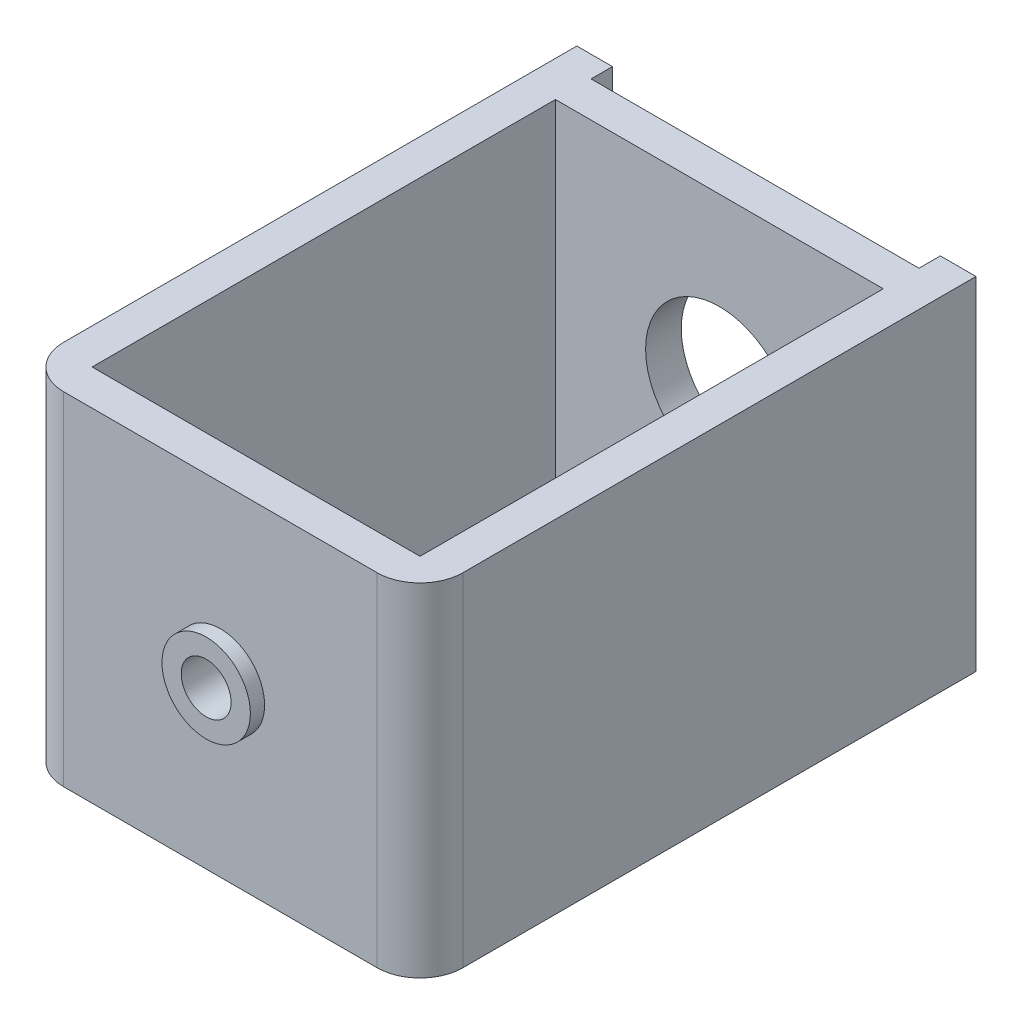
ISO-10303-21;
HEADER;
FILE_DESCRIPTION(('STEP AP214'),'2;1');
FILE_NAME('part.step','',(''),(''),'','','');
FILE_SCHEMA(('AUTOMOTIVE_DESIGN { 1 0 10303 214 1 1 1 1 }'));
ENDSEC;
DATA;
#1=APPLICATION_CONTEXT('core data for automotive mechanical design processes');
#2=APPLICATION_PROTOCOL_DEFINITION('international standard','automotive_design',2000,#1);
#3=PRODUCT_CONTEXT('',#1,'mechanical');
#4=PRODUCT('Part','Part','',(#3));
#5=PRODUCT_RELATED_PRODUCT_CATEGORY('part','',(#4));
#6=PRODUCT_DEFINITION_FORMATION('','',#4);
#7=PRODUCT_DEFINITION_CONTEXT('part definition',#1,'design');
#8=PRODUCT_DEFINITION('design','',#6,#7);
#9=PRODUCT_DEFINITION_SHAPE('','',#8);
#10=(LENGTH_UNIT() NAMED_UNIT(*) SI_UNIT(.MILLI.,.METRE.));
#11=(NAMED_UNIT(*) PLANE_ANGLE_UNIT() SI_UNIT($,.RADIAN.));
#12=(NAMED_UNIT(*) SI_UNIT($,.STERADIAN.) SOLID_ANGLE_UNIT());
#13=UNCERTAINTY_MEASURE_WITH_UNIT(LENGTH_MEASURE(1.E-05),#10,'distance_accuracy_value','');
#14=(GEOMETRIC_REPRESENTATION_CONTEXT(3) GLOBAL_UNCERTAINTY_ASSIGNED_CONTEXT((#13)) GLOBAL_UNIT_ASSIGNED_CONTEXT((#10,
#11,#12)) REPRESENTATION_CONTEXT('',''));
#15=CARTESIAN_POINT('',(0.,0.,0.));
#16=DIRECTION('',(0.,0.,1.));
#17=DIRECTION('',(1.,0.,0.));
#18=AXIS2_PLACEMENT_3D('',#15,#16,#17);
#19=CARTESIAN_POINT('',(0.,0.,0.));
#20=DIRECTION('',(0.,0.,-1.));
#21=DIRECTION('',(-1.,0.,0.));
#22=AXIS2_PLACEMENT_3D('',#19,#20,#21);
#23=PLANE('',#22);
#24=DIRECTION('',(0.,1.,0.));
#25=VECTOR('',#24,1.);
#26=CARTESIAN_POINT('',(2.5,0.,0.));
#27=LINE('',#26,#25);
#28=CARTESIAN_POINT('',(2.5,0.,0.));
#29=VERTEX_POINT('',#28);
#30=CARTESIAN_POINT('',(2.5,24.,0.));
#31=VERTEX_POINT('',#30);
#32=EDGE_CURVE('E176',#29,#31,#27,.T.);
#33=ORIENTED_EDGE('',*,*,#32,.F.);
#34=DIRECTION('',(1.,0.,0.));
#35=VECTOR('',#34,1.);
#36=CARTESIAN_POINT('',(0.,0.,0.));
#37=LINE('',#36,#35);
#38=CARTESIAN_POINT('',(0.,0.,0.));
#39=VERTEX_POINT('',#38);
#40=EDGE_CURVE('E222',#39,#29,#37,.T.);
#41=ORIENTED_EDGE('',*,*,#40,.F.);
#42=DIRECTION('',(0.,-1.,0.));
#43=VECTOR('',#42,1.);
#44=CARTESIAN_POINT('',(0.,0.,0.));
#45=LINE('',#44,#43);
#46=CARTESIAN_POINT('',(0.,24.,0.));
#47=VERTEX_POINT('',#46);
#48=EDGE_CURVE('E182',#47,#39,#45,.T.);
#49=ORIENTED_EDGE('',*,*,#48,.F.);
#50=DIRECTION('',(-1.,0.,0.));
#51=VECTOR('',#50,1.);
#52=CARTESIAN_POINT('',(0.,24.,0.));
#53=LINE('',#52,#51);
#54=EDGE_CURVE('E228',#31,#47,#53,.T.);
#55=ORIENTED_EDGE('',*,*,#54,.F.);
#56=EDGE_LOOP('',(#33,#41,#49,#55));
#57=FACE_BOUND('',#56,.T.);
#58=ADVANCED_FACE('F36',(#57),#23,.T.);
#59=CARTESIAN_POINT('',(0.,0.,39.));
#60=DIRECTION('',(1.,0.,0.));
#61=DIRECTION('',(0.,0.,-1.));
#62=AXIS2_PLACEMENT_3D('',#59,#60,#61);
#63=PLANE('',#62);
#64=DIRECTION('',(0.,0.,-1.));
#65=VECTOR('',#64,1.);
#66=CARTESIAN_POINT('',(0.,0.,39.));
#67=LINE('',#66,#65);
#68=CARTESIAN_POINT('',(0.,0.,36.));
#69=VERTEX_POINT('',#68);
#70=EDGE_CURVE('E236',#69,#39,#67,.T.);
#71=ORIENTED_EDGE('',*,*,#70,.F.);
#72=DIRECTION('',(0.,-1.,0.));
#73=VECTOR('',#72,1.);
#74=CARTESIAN_POINT('',(0.,0.,36.));
#75=LINE('',#74,#73);
#76=CARTESIAN_POINT('',(0.,24.,36.));
#77=VERTEX_POINT('',#76);
#78=EDGE_CURVE('E59',#69,#77,#75,.F.);
#79=ORIENTED_EDGE('',*,*,#78,.T.);
#80=DIRECTION('',(0.,0.,-1.));
#81=VECTOR('',#80,1.);
#82=CARTESIAN_POINT('',(0.,24.,39.));
#83=LINE('',#82,#81);
#84=EDGE_CURVE('E218',#77,#47,#83,.T.);
#85=ORIENTED_EDGE('',*,*,#84,.T.);
#86=ORIENTED_EDGE('',*,*,#48,.T.);
#87=EDGE_LOOP('',(#71,#79,#85,#86));
#88=FACE_BOUND('',#87,.T.);
#89=ADVANCED_FACE('F271',(#88),#63,.F.);
#90=CARTESIAN_POINT('',(0.,0.,39.));
#91=DIRECTION('',(0.,1.,0.));
#92=DIRECTION('',(0.,0.,1.));
#93=AXIS2_PLACEMENT_3D('',#90,#91,#92);
#94=PLANE('',#93);
#95=DIRECTION('',(-1.,0.,0.));
#96=VECTOR('',#95,1.);
#97=CARTESIAN_POINT('',(2.5,0.,4.));
#98=LINE('',#97,#96);
#99=CARTESIAN_POINT('',(25.5,0.,4.));
#100=VERTEX_POINT('',#99);
#101=CARTESIAN_POINT('',(2.5,0.,4.));
#102=VERTEX_POINT('',#101);
#103=EDGE_CURVE('E150',#100,#102,#98,.T.);
#104=ORIENTED_EDGE('',*,*,#103,.T.);
#105=DIRECTION('',(0.,0.,1.));
#106=VECTOR('',#105,1.);
#107=CARTESIAN_POINT('',(2.5,0.,4.));
#108=LINE('',#107,#106);
#109=CARTESIAN_POINT('',(2.5,0.,36.5));
#110=VERTEX_POINT('',#109);
#111=EDGE_CURVE('E142',#102,#110,#108,.T.);
#112=ORIENTED_EDGE('',*,*,#111,.T.);
#113=DIRECTION('',(1.,0.,0.));
#114=VECTOR('',#113,1.);
#115=CARTESIAN_POINT('',(2.5,0.,36.5));
#116=LINE('',#115,#114);
#117=CARTESIAN_POINT('',(25.5,0.,36.5));
#118=VERTEX_POINT('',#117);
#119=EDGE_CURVE('E154',#110,#118,#116,.T.);
#120=ORIENTED_EDGE('',*,*,#119,.T.);
#121=DIRECTION('',(0.,0.,-1.));
#122=VECTOR('',#121,1.);
#123=CARTESIAN_POINT('',(25.5,0.,4.));
#124=LINE('',#123,#122);
#125=EDGE_CURVE('E158',#118,#100,#124,.T.);
#126=ORIENTED_EDGE('',*,*,#125,.T.);
#127=EDGE_LOOP('',(#104,#112,#120,#126));
#128=FACE_BOUND('',#127,.T.);
#129=DIRECTION('',(1.,0.,0.));
#130=VECTOR('',#129,1.);
#131=CARTESIAN_POINT('',(0.,0.,39.));
#132=LINE('',#131,#130);
#133=CARTESIAN_POINT('',(3.,0.,39.));
#134=VERTEX_POINT('',#133);
#135=CARTESIAN_POINT('',(25.,0.,39.));
#136=VERTEX_POINT('',#135);
#137=EDGE_CURVE('E211',#134,#136,#132,.T.);
#138=ORIENTED_EDGE('',*,*,#137,.F.);
#139=CARTESIAN_POINT('',(3.,0.,36.));
#140=DIRECTION('',(0.,1.,0.));
#141=DIRECTION('',(0.,0.,1.));
#142=AXIS2_PLACEMENT_3D('',#139,#140,#141);
#143=CIRCLE('',#142,3.);
#144=EDGE_CURVE('E246',#134,#69,#143,.F.);
#145=ORIENTED_EDGE('',*,*,#144,.T.);
#146=ORIENTED_EDGE('',*,*,#70,.T.);
#147=ORIENTED_EDGE('',*,*,#40,.T.);
#148=DIRECTION('',(0.,0.,1.));
#149=VECTOR('',#148,1.);
#150=CARTESIAN_POINT('',(2.5,0.,0.));
#151=LINE('',#150,#149);
#152=CARTESIAN_POINT('',(2.5,0.,1.5));
#153=VERTEX_POINT('',#152);
#154=EDGE_CURVE('E186',#29,#153,#151,.T.);
#155=ORIENTED_EDGE('',*,*,#154,.T.);
#156=DIRECTION('',(1.,0.,0.));
#157=VECTOR('',#156,1.);
#158=CARTESIAN_POINT('',(2.5,0.,1.5));
#159=LINE('',#158,#157);
#160=CARTESIAN_POINT('',(25.5,0.,1.5));
#161=VERTEX_POINT('',#160);
#162=EDGE_CURVE('E189',#153,#161,#159,.T.);
#163=ORIENTED_EDGE('',*,*,#162,.T.);
#164=DIRECTION('',(0.,0.,-1.));
#165=VECTOR('',#164,1.);
#166=CARTESIAN_POINT('',(25.5,0.,0.));
#167=LINE('',#166,#165);
#168=CARTESIAN_POINT('',(25.5,0.,0.));
#169=VERTEX_POINT('',#168);
#170=EDGE_CURVE('E193',#161,#169,#167,.T.);
#171=ORIENTED_EDGE('',*,*,#170,.T.);
#172=CARTESIAN_POINT('',(28.,0.,0.));
#173=VERTEX_POINT('',#172);
#174=EDGE_CURVE('E221',#169,#173,#37,.T.);
#175=ORIENTED_EDGE('',*,*,#174,.T.);
#176=DIRECTION('',(0.,0.,-1.));
#177=VECTOR('',#176,1.);
#178=CARTESIAN_POINT('',(28.,0.,39.));
#179=LINE('',#178,#177);
#180=CARTESIAN_POINT('',(28.,0.,36.));
#181=VERTEX_POINT('',#180);
#182=EDGE_CURVE('E234',#181,#173,#179,.T.);
#183=ORIENTED_EDGE('',*,*,#182,.F.);
#184=CARTESIAN_POINT('',(25.,0.,36.));
#185=DIRECTION('',(0.,1.,0.));
#186=DIRECTION('',(0.,0.,1.));
#187=AXIS2_PLACEMENT_3D('',#184,#185,#186);
#188=CIRCLE('',#187,3.);
#189=EDGE_CURVE('E244',#181,#136,#188,.F.);
#190=ORIENTED_EDGE('',*,*,#189,.T.);
#191=EDGE_LOOP('',(#138,#145,#146,#147,#155,#163,#171,#175,#183,#190));
#192=FACE_BOUND('',#191,.T.);
#193=ADVANCED_FACE('F160',(#128,#192),#94,.F.);
#194=CARTESIAN_POINT('',(28.,0.,39.));
#195=DIRECTION('',(-1.,0.,0.));
#196=DIRECTION('',(0.,0.,1.));
#197=AXIS2_PLACEMENT_3D('',#194,#195,#196);
#198=PLANE('',#197);
#199=DIRECTION('',(0.,0.,-1.));
#200=VECTOR('',#199,1.);
#201=CARTESIAN_POINT('',(28.,24.,39.));
#202=LINE('',#201,#200);
#203=CARTESIAN_POINT('',(28.,24.,36.));
#204=VERTEX_POINT('',#203);
#205=CARTESIAN_POINT('',(28.,24.,0.));
#206=VERTEX_POINT('',#205);
#207=EDGE_CURVE('E232',#204,#206,#202,.T.);
#208=ORIENTED_EDGE('',*,*,#207,.F.);
#209=DIRECTION('',(0.,1.,0.));
#210=VECTOR('',#209,1.);
#211=CARTESIAN_POINT('',(28.,0.,36.));
#212=LINE('',#211,#210);
#213=EDGE_CURVE('E44',#204,#181,#212,.F.);
#214=ORIENTED_EDGE('',*,*,#213,.T.);
#215=ORIENTED_EDGE('',*,*,#182,.T.);
#216=DIRECTION('',(0.,1.,0.));
#217=VECTOR('',#216,1.);
#218=CARTESIAN_POINT('',(28.,0.,0.));
#219=LINE('',#218,#217);
#220=EDGE_CURVE('E225',#173,#206,#219,.T.);
#221=ORIENTED_EDGE('',*,*,#220,.T.);
#222=EDGE_LOOP('',(#208,#214,#215,#221));
#223=FACE_BOUND('',#222,.T.);
#224=ADVANCED_FACE('F254',(#223),#198,.F.);
#225=CARTESIAN_POINT('',(0.,24.,39.));
#226=DIRECTION('',(0.,-1.,0.));
#227=DIRECTION('',(0.,0.,-1.));
#228=AXIS2_PLACEMENT_3D('',#225,#226,#227);
#229=PLANE('',#228);
#230=DIRECTION('',(1.,0.,0.));
#231=VECTOR('',#230,1.);
#232=CARTESIAN_POINT('',(2.5,24.,36.5));
#233=LINE('',#232,#231);
#234=CARTESIAN_POINT('',(2.5,24.,36.5));
#235=VERTEX_POINT('',#234);
#236=CARTESIAN_POINT('',(25.5,24.,36.5));
#237=VERTEX_POINT('',#236);
#238=EDGE_CURVE('E175',#235,#237,#233,.T.);
#239=ORIENTED_EDGE('',*,*,#238,.F.);
#240=DIRECTION('',(0.,0.,1.));
#241=VECTOR('',#240,1.);
#242=CARTESIAN_POINT('',(2.5,24.,4.));
#243=LINE('',#242,#241);
#244=CARTESIAN_POINT('',(2.5,24.,4.));
#245=VERTEX_POINT('',#244);
#246=EDGE_CURVE('E145',#245,#235,#243,.T.);
#247=ORIENTED_EDGE('',*,*,#246,.F.);
#248=DIRECTION('',(-1.,0.,0.));
#249=VECTOR('',#248,1.);
#250=CARTESIAN_POINT('',(2.5,24.,4.));
#251=LINE('',#250,#249);
#252=CARTESIAN_POINT('',(25.5,24.,4.));
#253=VERTEX_POINT('',#252);
#254=EDGE_CURVE('E163',#253,#245,#251,.T.);
#255=ORIENTED_EDGE('',*,*,#254,.F.);
#256=DIRECTION('',(0.,0.,-1.));
#257=VECTOR('',#256,1.);
#258=CARTESIAN_POINT('',(25.5,24.,4.));
#259=LINE('',#258,#257);
#260=EDGE_CURVE('E166',#237,#253,#259,.T.);
#261=ORIENTED_EDGE('',*,*,#260,.F.);
#262=EDGE_LOOP('',(#239,#247,#255,#261));
#263=FACE_BOUND('',#262,.T.);
#264=ORIENTED_EDGE('',*,*,#84,.F.);
#265=CARTESIAN_POINT('',(3.,24.,36.));
#266=DIRECTION('',(0.,-1.,0.));
#267=DIRECTION('',(0.,0.,-1.));
#268=AXIS2_PLACEMENT_3D('',#265,#266,#267);
#269=CIRCLE('',#268,3.);
#270=CARTESIAN_POINT('',(3.,24.,39.));
#271=VERTEX_POINT('',#270);
#272=EDGE_CURVE('E250',#77,#271,#269,.F.);
#273=ORIENTED_EDGE('',*,*,#272,.T.);
#274=DIRECTION('',(-1.,0.,0.));
#275=VECTOR('',#274,1.);
#276=CARTESIAN_POINT('',(0.,24.,39.));
#277=LINE('',#276,#275);
#278=CARTESIAN_POINT('',(25.,24.,39.));
#279=VERTEX_POINT('',#278);
#280=EDGE_CURVE('E214',#279,#271,#277,.T.);
#281=ORIENTED_EDGE('',*,*,#280,.F.);
#282=CARTESIAN_POINT('',(25.,24.,36.));
#283=DIRECTION('',(0.,-1.,0.));
#284=DIRECTION('',(0.,0.,-1.));
#285=AXIS2_PLACEMENT_3D('',#282,#283,#284);
#286=CIRCLE('',#285,3.);
#287=EDGE_CURVE('E51',#279,#204,#286,.F.);
#288=ORIENTED_EDGE('',*,*,#287,.T.);
#289=ORIENTED_EDGE('',*,*,#207,.T.);
#290=CARTESIAN_POINT('',(25.5,24.,0.));
#291=VERTEX_POINT('',#290);
#292=EDGE_CURVE('E215',#206,#291,#53,.T.);
#293=ORIENTED_EDGE('',*,*,#292,.T.);
#294=DIRECTION('',(0.,0.,-1.));
#295=VECTOR('',#294,1.);
#296=CARTESIAN_POINT('',(25.5,24.,0.));
#297=LINE('',#296,#295);
#298=CARTESIAN_POINT('',(25.5,24.,1.5));
#299=VERTEX_POINT('',#298);
#300=EDGE_CURVE('E190',#299,#291,#297,.T.);
#301=ORIENTED_EDGE('',*,*,#300,.F.);
#302=DIRECTION('',(1.,0.,0.));
#303=VECTOR('',#302,1.);
#304=CARTESIAN_POINT('',(2.5,24.,1.5));
#305=LINE('',#304,#303);
#306=CARTESIAN_POINT('',(2.5,24.,1.5));
#307=VERTEX_POINT('',#306);
#308=EDGE_CURVE('E200',#307,#299,#305,.T.);
#309=ORIENTED_EDGE('',*,*,#308,.F.);
#310=DIRECTION('',(0.,0.,1.));
#311=VECTOR('',#310,1.);
#312=CARTESIAN_POINT('',(2.5,24.,0.));
#313=LINE('',#312,#311);
#314=EDGE_CURVE('E197',#31,#307,#313,.T.);
#315=ORIENTED_EDGE('',*,*,#314,.F.);
#316=ORIENTED_EDGE('',*,*,#54,.T.);
#317=EDGE_LOOP('',(#264,#273,#281,#288,#289,#293,#301,#309,#315,#316));
#318=FACE_BOUND('',#317,.T.);
#319=ADVANCED_FACE('F265',(#263,#318),#229,.F.);
#320=CARTESIAN_POINT('',(0.,0.,39.));
#321=DIRECTION('',(0.,0.,-1.));
#322=DIRECTION('',(-1.,0.,0.));
#323=AXIS2_PLACEMENT_3D('',#320,#321,#322);
#324=PLANE('',#323);
#325=CARTESIAN_POINT('',(14.,12.,39.));
#326=DIRECTION('',(0.,0.,-1.));
#327=DIRECTION('',(-1.,0.,0.));
#328=AXIS2_PLACEMENT_3D('',#325,#326,#327);
#329=CIRCLE('',#328,3.1);
#330=CARTESIAN_POINT('',(10.9,12.,39.));
#331=VERTEX_POINT('',#330);
#332=EDGE_CURVE('E11',#331,#331,#329,.F.);
#333=ORIENTED_EDGE('',*,*,#332,.F.);
#334=EDGE_LOOP('',(#333));
#335=FACE_BOUND('',#334,.T.);
#336=ORIENTED_EDGE('',*,*,#280,.T.);
#337=DIRECTION('',(0.,-1.,0.));
#338=VECTOR('',#337,1.);
#339=CARTESIAN_POINT('',(3.,0.,39.));
#340=LINE('',#339,#338);
#341=EDGE_CURVE('E241',#271,#134,#340,.T.);
#342=ORIENTED_EDGE('',*,*,#341,.T.);
#343=ORIENTED_EDGE('',*,*,#137,.T.);
#344=DIRECTION('',(0.,1.,0.));
#345=VECTOR('',#344,1.);
#346=CARTESIAN_POINT('',(25.,0.,39.));
#347=LINE('',#346,#345);
#348=EDGE_CURVE('E238',#136,#279,#347,.T.);
#349=ORIENTED_EDGE('',*,*,#348,.T.);
#350=EDGE_LOOP('',(#336,#342,#343,#349));
#351=FACE_BOUND('',#350,.T.);
#352=ADVANCED_FACE('F263',(#335,#351),#324,.F.);
#353=DIRECTION('',(0.,1.,0.));
#354=VECTOR('',#353,1.);
#355=CARTESIAN_POINT('',(25.5,0.,0.));
#356=LINE('',#355,#354);
#357=EDGE_CURVE('E205',#169,#291,#356,.T.);
#358=ORIENTED_EDGE('',*,*,#357,.T.);
#359=ORIENTED_EDGE('',*,*,#292,.F.);
#360=ORIENTED_EDGE('',*,*,#220,.F.);
#361=ORIENTED_EDGE('',*,*,#174,.F.);
#362=EDGE_LOOP('',(#358,#359,#360,#361));
#363=FACE_BOUND('',#362,.T.);
#364=ADVANCED_FACE('F288',(#363),#23,.T.);
#365=CARTESIAN_POINT('',(2.5,0.,0.));
#366=DIRECTION('',(-1.,0.,0.));
#367=DIRECTION('',(0.,0.,1.));
#368=AXIS2_PLACEMENT_3D('',#365,#366,#367);
#369=PLANE('',#368);
#370=ORIENTED_EDGE('',*,*,#314,.T.);
#371=DIRECTION('',(0.,1.,0.));
#372=VECTOR('',#371,1.);
#373=CARTESIAN_POINT('',(2.5,0.,1.5));
#374=LINE('',#373,#372);
#375=EDGE_CURVE('E196',#153,#307,#374,.T.);
#376=ORIENTED_EDGE('',*,*,#375,.F.);
#377=ORIENTED_EDGE('',*,*,#154,.F.);
#378=ORIENTED_EDGE('',*,*,#32,.T.);
#379=EDGE_LOOP('',(#370,#376,#377,#378));
#380=FACE_BOUND('',#379,.T.);
#381=ADVANCED_FACE('F278',(#380),#369,.F.);
#382=CARTESIAN_POINT('',(25.5,0.,0.));
#383=DIRECTION('',(1.,0.,0.));
#384=DIRECTION('',(0.,0.,-1.));
#385=AXIS2_PLACEMENT_3D('',#382,#383,#384);
#386=PLANE('',#385);
#387=ORIENTED_EDGE('',*,*,#300,.T.);
#388=ORIENTED_EDGE('',*,*,#357,.F.);
#389=ORIENTED_EDGE('',*,*,#170,.F.);
#390=DIRECTION('',(0.,1.,0.));
#391=VECTOR('',#390,1.);
#392=CARTESIAN_POINT('',(25.5,0.,1.5));
#393=LINE('',#392,#391);
#394=EDGE_CURVE('E208',#161,#299,#393,.T.);
#395=ORIENTED_EDGE('',*,*,#394,.T.);
#396=EDGE_LOOP('',(#387,#388,#389,#395));
#397=FACE_BOUND('',#396,.T.);
#398=ADVANCED_FACE('F286',(#397),#386,.F.);
#399=CARTESIAN_POINT('',(2.5,0.,1.5));
#400=DIRECTION('',(0.,0.,1.));
#401=DIRECTION('',(1.,0.,0.));
#402=AXIS2_PLACEMENT_3D('',#399,#400,#401);
#403=PLANE('',#402);
#404=CARTESIAN_POINT('',(14.,12.,1.5));
#405=DIRECTION('',(0.,0.,1.));
#406=DIRECTION('',(1.,0.,0.));
#407=AXIS2_PLACEMENT_3D('',#404,#405,#406);
#408=CIRCLE('',#407,5.175);
#409=CARTESIAN_POINT('',(19.175,12.,1.5));
#410=VERTEX_POINT('',#409);
#411=EDGE_CURVE('E169',#410,#410,#408,.F.);
#412=ORIENTED_EDGE('',*,*,#411,.F.);
#413=EDGE_LOOP('',(#412));
#414=FACE_BOUND('',#413,.T.);
#415=ORIENTED_EDGE('',*,*,#308,.T.);
#416=ORIENTED_EDGE('',*,*,#394,.F.);
#417=ORIENTED_EDGE('',*,*,#162,.F.);
#418=ORIENTED_EDGE('',*,*,#375,.T.);
#419=EDGE_LOOP('',(#415,#416,#417,#418));
#420=FACE_BOUND('',#419,.T.);
#421=ADVANCED_FACE('F282',(#414,#420),#403,.F.);
#422=CARTESIAN_POINT('',(2.5,0.,4.));
#423=DIRECTION('',(-1.,0.,0.));
#424=DIRECTION('',(0.,0.,1.));
#425=AXIS2_PLACEMENT_3D('',#422,#423,#424);
#426=PLANE('',#425);
#427=ORIENTED_EDGE('',*,*,#246,.T.);
#428=DIRECTION('',(0.,1.,0.));
#429=VECTOR('',#428,1.);
#430=CARTESIAN_POINT('',(2.5,0.,36.5));
#431=LINE('',#430,#429);
#432=EDGE_CURVE('E138',#110,#235,#431,.T.);
#433=ORIENTED_EDGE('',*,*,#432,.F.);
#434=ORIENTED_EDGE('',*,*,#111,.F.);
#435=DIRECTION('',(0.,1.,0.));
#436=VECTOR('',#435,1.);
#437=CARTESIAN_POINT('',(2.5,0.,4.));
#438=LINE('',#437,#436);
#439=EDGE_CURVE('E180',#102,#245,#438,.T.);
#440=ORIENTED_EDGE('',*,*,#439,.T.);
#441=EDGE_LOOP('',(#427,#433,#434,#440));
#442=FACE_BOUND('',#441,.T.);
#443=ADVANCED_FACE('F140',(#442),#426,.F.);
#444=CARTESIAN_POINT('',(2.5,0.,4.));
#445=DIRECTION('',(0.,0.,-1.));
#446=DIRECTION('',(-1.,0.,0.));
#447=AXIS2_PLACEMENT_3D('',#444,#445,#446);
#448=PLANE('',#447);
#449=CARTESIAN_POINT('',(14.,12.,4.));
#450=DIRECTION('',(0.,0.,-1.));
#451=DIRECTION('',(-1.,0.,0.));
#452=AXIS2_PLACEMENT_3D('',#449,#450,#451);
#453=CIRCLE('',#452,5.175);
#454=CARTESIAN_POINT('',(8.825,12.,4.));
#455=VERTEX_POINT('',#454);
#456=EDGE_CURVE('E352',#455,#455,#453,.F.);
#457=ORIENTED_EDGE('',*,*,#456,.F.);
#458=EDGE_LOOP('',(#457));
#459=FACE_BOUND('',#458,.T.);
#460=ORIENTED_EDGE('',*,*,#254,.T.);
#461=ORIENTED_EDGE('',*,*,#439,.F.);
#462=ORIENTED_EDGE('',*,*,#103,.F.);
#463=DIRECTION('',(0.,1.,0.));
#464=VECTOR('',#463,1.);
#465=CARTESIAN_POINT('',(25.5,0.,4.));
#466=LINE('',#465,#464);
#467=EDGE_CURVE('E183',#100,#253,#466,.T.);
#468=ORIENTED_EDGE('',*,*,#467,.T.);
#469=EDGE_LOOP('',(#460,#461,#462,#468));
#470=FACE_BOUND('',#469,.T.);
#471=ADVANCED_FACE('F330',(#459,#470),#448,.F.);
#472=CARTESIAN_POINT('',(25.5,0.,4.));
#473=DIRECTION('',(1.,0.,0.));
#474=DIRECTION('',(0.,0.,-1.));
#475=AXIS2_PLACEMENT_3D('',#472,#473,#474);
#476=PLANE('',#475);
#477=ORIENTED_EDGE('',*,*,#260,.T.);
#478=ORIENTED_EDGE('',*,*,#467,.F.);
#479=ORIENTED_EDGE('',*,*,#125,.F.);
#480=DIRECTION('',(0.,1.,0.));
#481=VECTOR('',#480,1.);
#482=CARTESIAN_POINT('',(25.5,0.,36.5));
#483=LINE('',#482,#481);
#484=EDGE_CURVE('E149',#118,#237,#483,.T.);
#485=ORIENTED_EDGE('',*,*,#484,.T.);
#486=EDGE_LOOP('',(#477,#478,#479,#485));
#487=FACE_BOUND('',#486,.T.);
#488=ADVANCED_FACE('F333',(#487),#476,.F.);
#489=CARTESIAN_POINT('',(2.5,0.,36.5));
#490=DIRECTION('',(0.,0.,1.));
#491=DIRECTION('',(1.,0.,0.));
#492=AXIS2_PLACEMENT_3D('',#489,#490,#491);
#493=PLANE('',#492);
#494=CARTESIAN_POINT('',(14.,12.,36.5));
#495=DIRECTION('',(0.,0.,1.));
#496=DIRECTION('',(1.,0.,0.));
#497=AXIS2_PLACEMENT_3D('',#494,#495,#496);
#498=CIRCLE('',#497,1.75);
#499=CARTESIAN_POINT('',(15.75,12.,36.5));
#500=VERTEX_POINT('',#499);
#501=EDGE_CURVE('E354',#500,#500,#498,.F.);
#502=ORIENTED_EDGE('',*,*,#501,.F.);
#503=EDGE_LOOP('',(#502));
#504=FACE_BOUND('',#503,.T.);
#505=ORIENTED_EDGE('',*,*,#238,.T.);
#506=ORIENTED_EDGE('',*,*,#484,.F.);
#507=ORIENTED_EDGE('',*,*,#119,.F.);
#508=ORIENTED_EDGE('',*,*,#432,.T.);
#509=EDGE_LOOP('',(#505,#506,#507,#508));
#510=FACE_BOUND('',#509,.T.);
#511=ADVANCED_FACE('F155',(#504,#510),#493,.F.);
#512=CARTESIAN_POINT('',(14.,12.,39.001));
#513=DIRECTION('',(0.,0.,-1.));
#514=DIRECTION('',(-1.,0.,0.));
#515=AXIS2_PLACEMENT_3D('',#512,#513,#514);
#516=CYLINDRICAL_SURFACE('',#515,5.175);
#517=ORIENTED_EDGE('',*,*,#456,.T.);
#518=EDGE_LOOP('',(#517));
#519=FACE_BOUND('',#518,.T.);
#520=ORIENTED_EDGE('',*,*,#411,.T.);
#521=EDGE_LOOP('',(#520));
#522=FACE_BOUND('',#521,.T.);
#523=ADVANCED_FACE('F317',(#519,#522),#516,.F.);
#524=CARTESIAN_POINT('',(14.,12.,-0.001000000000001));
#525=DIRECTION('',(0.,0.,1.));
#526=DIRECTION('',(1.,0.,0.));
#527=AXIS2_PLACEMENT_3D('',#524,#525,#526);
#528=CYLINDRICAL_SURFACE('',#527,1.75);
#529=ORIENTED_EDGE('',*,*,#501,.T.);
#530=EDGE_LOOP('',(#529));
#531=FACE_BOUND('',#530,.T.);
#532=CARTESIAN_POINT('',(14.,12.,40.));
#533=DIRECTION('',(0.,0.,1.));
#534=DIRECTION('',(1.,0.,0.));
#535=AXIS2_PLACEMENT_3D('',#532,#533,#534);
#536=CIRCLE('',#535,1.75);
#537=CARTESIAN_POINT('',(15.75,12.,40.));
#538=VERTEX_POINT('',#537);
#539=EDGE_CURVE('E361',#538,#538,#536,.F.);
#540=ORIENTED_EDGE('',*,*,#539,.F.);
#541=EDGE_LOOP('',(#540));
#542=FACE_BOUND('',#541,.T.);
#543=ADVANCED_FACE('F311',(#531,#542),#528,.F.);
#544=CARTESIAN_POINT('',(3.,0.,36.));
#545=DIRECTION('',(0.,-1.,0.));
#546=DIRECTION('',(0.,0.,-1.));
#547=AXIS2_PLACEMENT_3D('',#544,#545,#546);
#548=CYLINDRICAL_SURFACE('',#547,3.);
#549=ORIENTED_EDGE('',*,*,#272,.F.);
#550=ORIENTED_EDGE('',*,*,#78,.F.);
#551=ORIENTED_EDGE('',*,*,#144,.F.);
#552=ORIENTED_EDGE('',*,*,#341,.F.);
#553=EDGE_LOOP('',(#549,#550,#551,#552));
#554=FACE_BOUND('',#553,.T.);
#555=ADVANCED_FACE('F269',(#554),#548,.T.);
#556=CARTESIAN_POINT('',(25.,0.,36.));
#557=DIRECTION('',(0.,1.,0.));
#558=DIRECTION('',(0.,0.,1.));
#559=AXIS2_PLACEMENT_3D('',#556,#557,#558);
#560=CYLINDRICAL_SURFACE('',#559,3.);
#561=ORIENTED_EDGE('',*,*,#189,.F.);
#562=ORIENTED_EDGE('',*,*,#213,.F.);
#563=ORIENTED_EDGE('',*,*,#287,.F.);
#564=ORIENTED_EDGE('',*,*,#348,.F.);
#565=EDGE_LOOP('',(#561,#562,#563,#564));
#566=FACE_BOUND('',#565,.T.);
#567=ADVANCED_FACE('F38',(#566),#560,.T.);
#568=CARTESIAN_POINT('',(14.,12.,40.));
#569=DIRECTION('',(0.,0.,-1.));
#570=DIRECTION('',(-1.,0.,0.));
#571=AXIS2_PLACEMENT_3D('',#568,#569,#570);
#572=CYLINDRICAL_SURFACE('',#571,3.1);
#573=CARTESIAN_POINT('',(14.,12.,40.));
#574=DIRECTION('',(0.,0.,1.));
#575=DIRECTION('',(1.,0.,0.));
#576=AXIS2_PLACEMENT_3D('',#573,#574,#575);
#577=CIRCLE('',#576,3.1);
#578=CARTESIAN_POINT('',(17.1,12.,40.));
#579=VERTEX_POINT('',#578);
#580=EDGE_CURVE('E356',#579,#579,#577,.T.);
#581=ORIENTED_EDGE('',*,*,#580,.F.);
#582=EDGE_LOOP('',(#581));
#583=FACE_BOUND('',#582,.T.);
#584=ORIENTED_EDGE('',*,*,#332,.T.);
#585=EDGE_LOOP('',(#584));
#586=FACE_BOUND('',#585,.T.);
#587=ADVANCED_FACE('F316',(#583,#586),#572,.T.);
#588=CARTESIAN_POINT('',(0.,0.,40.));
#589=DIRECTION('',(0.,0.,1.));
#590=DIRECTION('',(1.,0.,0.));
#591=AXIS2_PLACEMENT_3D('',#588,#589,#590);
#592=PLANE('',#591);
#593=ORIENTED_EDGE('',*,*,#539,.T.);
#594=EDGE_LOOP('',(#593));
#595=FACE_BOUND('',#594,.T.);
#596=ORIENTED_EDGE('',*,*,#580,.T.);
#597=EDGE_LOOP('',(#596));
#598=FACE_BOUND('',#597,.T.);
#599=ADVANCED_FACE('F365',(#595,#598),#592,.T.);
#600=CLOSED_SHELL('',(#58,#89,#193,#224,#319,#352,#364,#381,#398,#421,#443,#471,#488,#511,#523,
#543,#555,#567,#587,#599));
#601=MANIFOLD_SOLID_BREP('B2',#600);
#602=ADVANCED_BREP_SHAPE_REPRESENTATION('',(#18,#601),#14);
#603=SHAPE_DEFINITION_REPRESENTATION(#9,#602);
ENDSEC;
END-ISO-10303-21;
